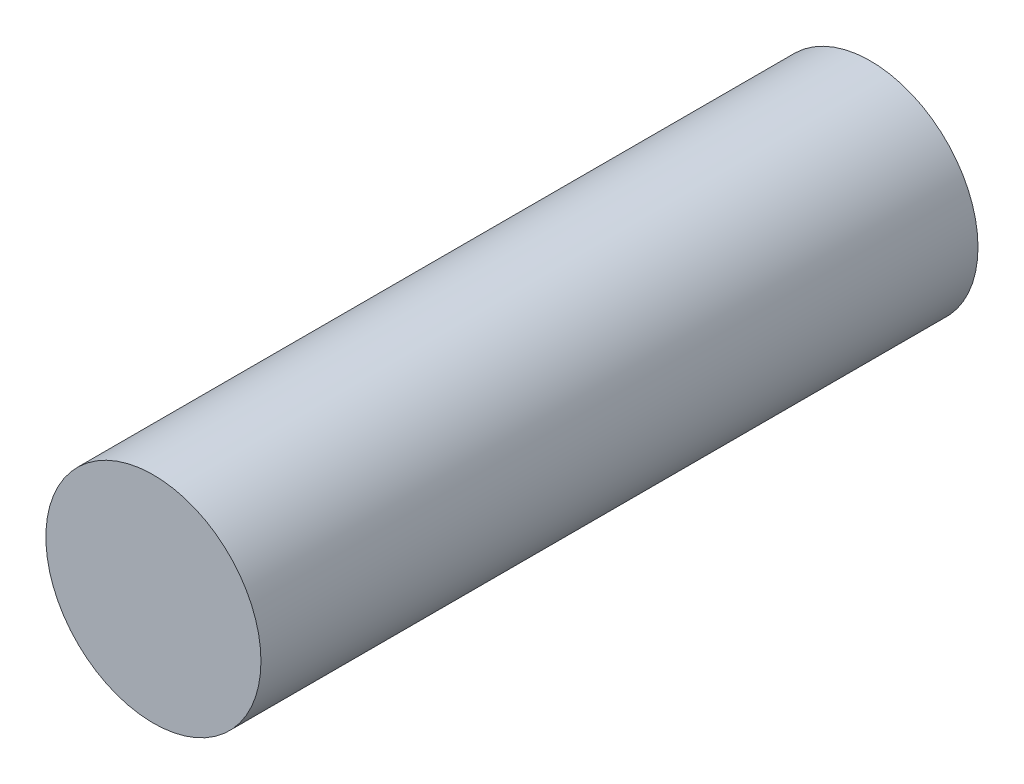
ISO-10303-21;
HEADER;
FILE_DESCRIPTION(('STEP AP214'),'2;1');
FILE_NAME('part.step','',(''),(''),'','','');
FILE_SCHEMA(('AUTOMOTIVE_DESIGN { 1 0 10303 214 1 1 1 1 }'));
ENDSEC;
DATA;
#1=APPLICATION_CONTEXT('core data for automotive mechanical design processes');
#2=APPLICATION_PROTOCOL_DEFINITION('international standard','automotive_design',2000,#1);
#3=PRODUCT_CONTEXT('',#1,'mechanical');
#4=PRODUCT('Part','Part','',(#3));
#5=PRODUCT_RELATED_PRODUCT_CATEGORY('part','',(#4));
#6=PRODUCT_DEFINITION_FORMATION('','',#4);
#7=PRODUCT_DEFINITION_CONTEXT('part definition',#1,'design');
#8=PRODUCT_DEFINITION('design','',#6,#7);
#9=PRODUCT_DEFINITION_SHAPE('','',#8);
#10=(LENGTH_UNIT() NAMED_UNIT(*) SI_UNIT(.MILLI.,.METRE.));
#11=(NAMED_UNIT(*) PLANE_ANGLE_UNIT() SI_UNIT($,.RADIAN.));
#12=(NAMED_UNIT(*) SI_UNIT($,.STERADIAN.) SOLID_ANGLE_UNIT());
#13=UNCERTAINTY_MEASURE_WITH_UNIT(LENGTH_MEASURE(1.E-05),#10,'distance_accuracy_value','');
#14=(GEOMETRIC_REPRESENTATION_CONTEXT(3) GLOBAL_UNCERTAINTY_ASSIGNED_CONTEXT((#13)) GLOBAL_UNIT_ASSIGNED_CONTEXT((#10,
#11,#12)) REPRESENTATION_CONTEXT('',''));
#15=CARTESIAN_POINT('',(0.,0.,0.));
#16=DIRECTION('',(0.,0.,1.));
#17=DIRECTION('',(1.,0.,0.));
#18=AXIS2_PLACEMENT_3D('',#15,#16,#17);
#19=CARTESIAN_POINT('',(0.,0.,50.8));
#20=DIRECTION('',(0.,0.,-1.));
#21=DIRECTION('',(-1.,0.,0.));
#22=AXIS2_PLACEMENT_3D('',#19,#20,#21);
#23=CYLINDRICAL_SURFACE('',#22,7.62);
#24=CARTESIAN_POINT('',(0.,0.,50.8));
#25=DIRECTION('',(0.,0.,1.));
#26=DIRECTION('',(1.,0.,0.));
#27=AXIS2_PLACEMENT_3D('',#24,#25,#26);
#28=CIRCLE('',#27,7.62);
#29=CARTESIAN_POINT('',(7.62,0.,50.8));
#30=VERTEX_POINT('',#29);
#31=EDGE_CURVE('E10',#30,#30,#28,.T.);
#32=ORIENTED_EDGE('',*,*,#31,.F.);
#33=EDGE_LOOP('',(#32));
#34=FACE_BOUND('',#33,.T.);
#35=CARTESIAN_POINT('',(0.,0.,0.));
#36=DIRECTION('',(0.,0.,1.));
#37=DIRECTION('',(1.,0.,0.));
#38=AXIS2_PLACEMENT_3D('',#35,#36,#37);
#39=CIRCLE('',#38,7.62);
#40=CARTESIAN_POINT('',(7.62,0.,0.));
#41=VERTEX_POINT('',#40);
#42=EDGE_CURVE('E43',#41,#41,#39,.T.);
#43=ORIENTED_EDGE('',*,*,#42,.T.);
#44=EDGE_LOOP('',(#43));
#45=FACE_BOUND('',#44,.T.);
#46=ADVANCED_FACE('F37',(#34,#45),#23,.T.);
#47=CARTESIAN_POINT('',(0.,0.,50.8));
#48=DIRECTION('',(0.,0.,1.));
#49=DIRECTION('',(1.,0.,0.));
#50=AXIS2_PLACEMENT_3D('',#47,#48,#49);
#51=PLANE('',#50);
#52=ORIENTED_EDGE('',*,*,#31,.T.);
#53=EDGE_LOOP('',(#52));
#54=FACE_BOUND('',#53,.T.);
#55=ADVANCED_FACE('F52',(#54),#51,.T.);
#56=CARTESIAN_POINT('',(0.,0.,0.));
#57=DIRECTION('',(0.,0.,1.));
#58=DIRECTION('',(1.,0.,0.));
#59=AXIS2_PLACEMENT_3D('',#56,#57,#58);
#60=PLANE('',#59);
#61=ORIENTED_EDGE('',*,*,#42,.F.);
#62=EDGE_LOOP('',(#61));
#63=FACE_BOUND('',#62,.T.);
#64=ADVANCED_FACE('F50',(#63),#60,.F.);
#65=CLOSED_SHELL('',(#46,#55,#64));
#66=MANIFOLD_SOLID_BREP('B2',#65);
#67=ADVANCED_BREP_SHAPE_REPRESENTATION('',(#18,#66),#14);
#68=SHAPE_DEFINITION_REPRESENTATION(#9,#67);
ENDSEC;
END-ISO-10303-21;
